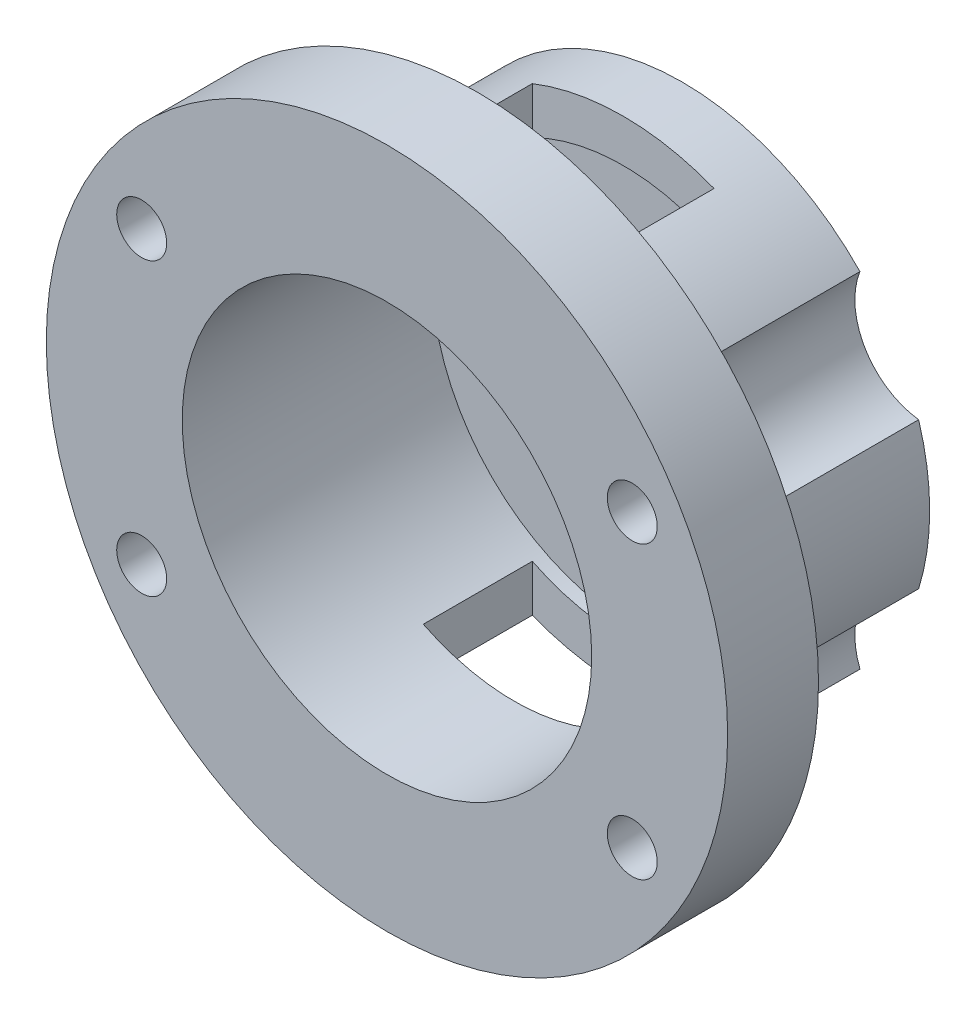
ISO-10303-21;
HEADER;
FILE_DESCRIPTION(('STEP AP214'),'2;1');
FILE_NAME('part.step','',(''),(''),'','','');
FILE_SCHEMA(('AUTOMOTIVE_DESIGN { 1 0 10303 214 1 1 1 1 }'));
ENDSEC;
DATA;
#1=APPLICATION_CONTEXT('core data for automotive mechanical design processes');
#2=APPLICATION_PROTOCOL_DEFINITION('international standard','automotive_design',2000,#1);
#3=PRODUCT_CONTEXT('',#1,'mechanical');
#4=PRODUCT('Part','Part','',(#3));
#5=PRODUCT_RELATED_PRODUCT_CATEGORY('part','',(#4));
#6=PRODUCT_DEFINITION_FORMATION('','',#4);
#7=PRODUCT_DEFINITION_CONTEXT('part definition',#1,'design');
#8=PRODUCT_DEFINITION('design','',#6,#7);
#9=PRODUCT_DEFINITION_SHAPE('','',#8);
#10=(LENGTH_UNIT() NAMED_UNIT(*) SI_UNIT(.MILLI.,.METRE.));
#11=(NAMED_UNIT(*) PLANE_ANGLE_UNIT() SI_UNIT($,.RADIAN.));
#12=(NAMED_UNIT(*) SI_UNIT($,.STERADIAN.) SOLID_ANGLE_UNIT());
#13=UNCERTAINTY_MEASURE_WITH_UNIT(LENGTH_MEASURE(1.E-05),#10,'distance_accuracy_value','');
#14=(GEOMETRIC_REPRESENTATION_CONTEXT(3) GLOBAL_UNCERTAINTY_ASSIGNED_CONTEXT((#13)) GLOBAL_UNIT_ASSIGNED_CONTEXT((#10,
#11,#12)) REPRESENTATION_CONTEXT('',''));
#15=CARTESIAN_POINT('',(0.,0.,0.));
#16=DIRECTION('',(0.,0.,1.));
#17=DIRECTION('',(1.,0.,0.));
#18=AXIS2_PLACEMENT_3D('',#15,#16,#17);
#19=CARTESIAN_POINT('',(0.,0.,8.));
#20=DIRECTION('',(0.,0.,1.));
#21=DIRECTION('',(1.,0.,0.));
#22=AXIS2_PLACEMENT_3D('',#19,#20,#21);
#23=CYLINDRICAL_SURFACE('',#22,22.5361893631846);
#24=CARTESIAN_POINT('',(0.,0.,20.));
#25=DIRECTION('',(0.,0.,1.));
#26=DIRECTION('',(1.,0.,0.));
#27=AXIS2_PLACEMENT_3D('',#24,#25,#26);
#28=CIRCLE('',#27,22.5361893631846);
#29=CARTESIAN_POINT('',(22.5361893631846,0.,20.));
#30=VERTEX_POINT('',#29);
#31=EDGE_CURVE('E292',#30,#30,#28,.T.);
#32=ORIENTED_EDGE('',*,*,#31,.T.);
#33=EDGE_LOOP('',(#32));
#34=FACE_BOUND('',#33,.T.);
#35=CARTESIAN_POINT('',(0.,0.,-6.));
#36=DIRECTION('',(0.,0.,-1.));
#37=DIRECTION('',(-1.,0.,0.));
#38=AXIS2_PLACEMENT_3D('',#35,#36,#37);
#39=CIRCLE('',#38,22.5361893631846);
#40=CARTESIAN_POINT('',(10.,20.1960350319886,-6.));
#41=VERTEX_POINT('',#40);
#42=CARTESIAN_POINT('',(-9.99999999999999,20.1960350319886,-6.));
#43=VERTEX_POINT('',#42);
#44=EDGE_CURVE('E238',#41,#43,#39,.F.);
#45=ORIENTED_EDGE('',*,*,#44,.T.);
#46=DIRECTION('',(0.,0.,1.));
#47=VECTOR('',#46,1.);
#48=CARTESIAN_POINT('',(-9.99999999999999,20.1960350319886,8.));
#49=LINE('',#48,#47);
#50=CARTESIAN_POINT('',(-9.99999999999999,20.1960350319886,6.));
#51=VERTEX_POINT('',#50);
#52=EDGE_CURVE('E244',#43,#51,#49,.T.);
#53=ORIENTED_EDGE('',*,*,#52,.T.);
#54=CARTESIAN_POINT('',(0.,0.,6.));
#55=DIRECTION('',(0.,0.,1.));
#56=DIRECTION('',(1.,0.,0.));
#57=AXIS2_PLACEMENT_3D('',#54,#55,#56);
#58=CIRCLE('',#57,22.5361893631846);
#59=CARTESIAN_POINT('',(9.99999999999999,20.1960350319886,6.));
#60=VERTEX_POINT('',#59);
#61=EDGE_CURVE('E224',#51,#60,#58,.F.);
#62=ORIENTED_EDGE('',*,*,#61,.T.);
#63=DIRECTION('',(0.,0.,1.));
#64=VECTOR('',#63,1.);
#65=CARTESIAN_POINT('',(9.99999999999999,20.1960350319886,8.));
#66=LINE('',#65,#64);
#67=EDGE_CURVE('E233',#60,#41,#66,.F.);
#68=ORIENTED_EDGE('',*,*,#67,.T.);
#69=EDGE_LOOP('',(#45,#53,#62,#68));
#70=FACE_BOUND('',#69,.T.);
#71=CARTESIAN_POINT('',(9.99999999999999,-20.1960350319886,6.));
#72=VERTEX_POINT('',#71);
#73=CARTESIAN_POINT('',(-9.99999999999999,-20.1960350319886,6.));
#74=VERTEX_POINT('',#73);
#75=EDGE_CURVE('E227',#72,#74,#58,.F.);
#76=ORIENTED_EDGE('',*,*,#75,.T.);
#77=DIRECTION('',(0.,0.,1.));
#78=VECTOR('',#77,1.);
#79=CARTESIAN_POINT('',(-9.99999999999999,-20.1960350319886,8.));
#80=LINE('',#79,#78);
#81=CARTESIAN_POINT('',(-9.99999999999999,-20.1960350319886,-6.));
#82=VERTEX_POINT('',#81);
#83=EDGE_CURVE('E247',#74,#82,#80,.F.);
#84=ORIENTED_EDGE('',*,*,#83,.T.);
#85=CARTESIAN_POINT('',(10.,-20.1960350319887,-6.));
#86=VERTEX_POINT('',#85);
#87=EDGE_CURVE('E241',#82,#86,#39,.F.);
#88=ORIENTED_EDGE('',*,*,#87,.T.);
#89=DIRECTION('',(0.,0.,1.));
#90=VECTOR('',#89,1.);
#91=CARTESIAN_POINT('',(9.99999999999999,-20.1960350319886,8.));
#92=LINE('',#91,#90);
#93=EDGE_CURVE('E230',#86,#72,#92,.T.);
#94=ORIENTED_EDGE('',*,*,#93,.T.);
#95=EDGE_LOOP('',(#76,#84,#88,#94));
#96=FACE_BOUND('',#95,.T.);
#97=CARTESIAN_POINT('',(0.,0.,-7.5));
#98=DIRECTION('',(0.,0.,-1.));
#99=DIRECTION('',(-1.,0.,0.));
#100=AXIS2_PLACEMENT_3D('',#97,#98,#99);
#101=CIRCLE('',#100,22.5361893631846);
#102=CARTESIAN_POINT('',(-22.5361893631846,0.,-7.5));
#103=VERTEX_POINT('',#102);
#104=EDGE_CURVE('E11',#103,#103,#101,.F.);
#105=ORIENTED_EDGE('',*,*,#104,.F.);
#106=EDGE_LOOP('',(#105));
#107=FACE_BOUND('',#106,.T.);
#108=ADVANCED_FACE('F43',(#34,#70,#96,#107),#23,.F.);
#109=CARTESIAN_POINT('',(0.,0.,10.));
#110=DIRECTION('',(0.,0.,-1.));
#111=DIRECTION('',(-1.,0.,0.));
#112=AXIS2_PLACEMENT_3D('',#109,#110,#111);
#113=CYLINDRICAL_SURFACE('',#112,27.2402260374026);
#114=DIRECTION('',(0.,0.,-1.));
#115=VECTOR('',#114,1.);
#116=CARTESIAN_POINT('',(-26.0204366331113,-8.06019801189918,5.));
#117=LINE('',#116,#115);
#118=CARTESIAN_POINT('',(-26.0204366331113,-8.06019801189918,10.));
#119=VERTEX_POINT('',#118);
#120=CARTESIAN_POINT('',(-26.0204366331113,-8.06019801189918,-12.5));
#121=VERTEX_POINT('',#120);
#122=EDGE_CURVE('E272',#119,#121,#117,.T.);
#123=ORIENTED_EDGE('',*,*,#122,.F.);
#124=CARTESIAN_POINT('',(0.,0.,10.));
#125=DIRECTION('',(0.,0.,-1.));
#126=DIRECTION('',(-1.,0.,0.));
#127=AXIS2_PLACEMENT_3D('',#124,#125,#126);
#128=CIRCLE('',#127,27.2402260374026);
#129=CARTESIAN_POINT('',(-26.0204366331113,8.06019801189919,10.));
#130=VERTEX_POINT('',#129);
#131=EDGE_CURVE('E274',#119,#130,#128,.T.);
#132=ORIENTED_EDGE('',*,*,#131,.T.);
#133=DIRECTION('',(0.,0.,-1.));
#134=VECTOR('',#133,1.);
#135=CARTESIAN_POINT('',(-26.0204366331113,8.06019801189919,5.));
#136=LINE('',#135,#134);
#137=CARTESIAN_POINT('',(-26.0204366331113,8.0601980118992,-12.5));
#138=VERTEX_POINT('',#137);
#139=EDGE_CURVE('E262',#138,#130,#136,.F.);
#140=ORIENTED_EDGE('',*,*,#139,.F.);
#141=CARTESIAN_POINT('',(0.,0.,-12.5));
#142=DIRECTION('',(0.,0.,-1.));
#143=DIRECTION('',(-1.,0.,0.));
#144=AXIS2_PLACEMENT_3D('',#141,#142,#143);
#145=CIRCLE('',#144,27.2402260374026);
#146=EDGE_CURVE('E192',#121,#138,#145,.T.);
#147=ORIENTED_EDGE('',*,*,#146,.F.);
#148=EDGE_LOOP('',(#123,#132,#140,#147));
#149=FACE_BOUND('',#148,.T.);
#150=ADVANCED_FACE('F345',(#149),#113,.T.);
#151=DIRECTION('',(0.,0.,-1.));
#152=VECTOR('',#151,1.);
#153=CARTESIAN_POINT('',(-9.99999999999999,-25.3383092286914,10.));
#154=LINE('',#153,#152);
#155=CARTESIAN_POINT('',(-9.99999999999999,-25.3383092286914,6.));
#156=VERTEX_POINT('',#155);
#157=CARTESIAN_POINT('',(-9.99999999999999,-25.3383092286914,-6.));
#158=VERTEX_POINT('',#157);
#159=EDGE_CURVE('E250',#156,#158,#154,.T.);
#160=ORIENTED_EDGE('',*,*,#159,.F.);
#161=CARTESIAN_POINT('',(0.,0.,6.));
#162=DIRECTION('',(0.,0.,1.));
#163=DIRECTION('',(1.,0.,0.));
#164=AXIS2_PLACEMENT_3D('',#161,#162,#163);
#165=CIRCLE('',#164,27.2402260374026);
#166=CARTESIAN_POINT('',(9.99999999999999,-25.3383092286914,6.));
#167=VERTEX_POINT('',#166);
#168=EDGE_CURVE('E228',#167,#156,#165,.F.);
#169=ORIENTED_EDGE('',*,*,#168,.F.);
#170=DIRECTION('',(0.,0.,-1.));
#171=VECTOR('',#170,1.);
#172=CARTESIAN_POINT('',(9.99999999999999,-25.3383092286914,10.));
#173=LINE('',#172,#171);
#174=CARTESIAN_POINT('',(10.,-25.3383092286914,-6.));
#175=VERTEX_POINT('',#174);
#176=EDGE_CURVE('E236',#175,#167,#173,.F.);
#177=ORIENTED_EDGE('',*,*,#176,.F.);
#178=CARTESIAN_POINT('',(0.,0.,-6.));
#179=DIRECTION('',(0.,0.,-1.));
#180=DIRECTION('',(-1.,0.,0.));
#181=AXIS2_PLACEMENT_3D('',#178,#179,#180);
#182=CIRCLE('',#181,27.2402260374026);
#183=EDGE_CURVE('E242',#158,#175,#182,.F.);
#184=ORIENTED_EDGE('',*,*,#183,.F.);
#185=EDGE_LOOP('',(#160,#169,#177,#184));
#186=FACE_BOUND('',#185,.T.);
#187=DIRECTION('',(0.,0.,-1.));
#188=VECTOR('',#187,1.);
#189=CARTESIAN_POINT('',(-19.5651549337488,-18.9534858795735,5.));
#190=LINE('',#189,#188);
#191=CARTESIAN_POINT('',(-19.5651549337488,-18.9534858795735,-12.5));
#192=VERTEX_POINT('',#191);
#193=CARTESIAN_POINT('',(-19.5651549337488,-18.9534858795735,10.));
#194=VERTEX_POINT('',#193);
#195=EDGE_CURVE('E270',#192,#194,#190,.F.);
#196=ORIENTED_EDGE('',*,*,#195,.F.);
#197=CARTESIAN_POINT('',(0.,0.,-12.5));
#198=DIRECTION('',(0.,0.,-1.));
#199=DIRECTION('',(-1.,0.,0.));
#200=AXIS2_PLACEMENT_3D('',#197,#198,#199);
#201=CIRCLE('',#200,27.2402260374026);
#202=CARTESIAN_POINT('',(19.5651549337488,-18.9534858795735,-12.5));
#203=VERTEX_POINT('',#202);
#204=EDGE_CURVE('E186',#203,#192,#201,.T.);
#205=ORIENTED_EDGE('',*,*,#204,.F.);
#206=DIRECTION('',(0.,0.,-1.));
#207=VECTOR('',#206,1.);
#208=CARTESIAN_POINT('',(19.5651549337488,-18.9534858795735,5.));
#209=LINE('',#208,#207);
#210=CARTESIAN_POINT('',(19.5651549337488,-18.9534858795735,10.));
#211=VERTEX_POINT('',#210);
#212=EDGE_CURVE('E268',#211,#203,#209,.T.);
#213=ORIENTED_EDGE('',*,*,#212,.F.);
#214=EDGE_CURVE('E277',#211,#194,#128,.T.);
#215=ORIENTED_EDGE('',*,*,#214,.T.);
#216=EDGE_LOOP('',(#196,#205,#213,#215));
#217=FACE_BOUND('',#216,.T.);
#218=ADVANCED_FACE('F351',(#186,#217),#113,.T.);
#219=DIRECTION('',(0.,0.,-1.));
#220=VECTOR('',#219,1.);
#221=CARTESIAN_POINT('',(26.0204366331113,-8.06019801189917,5.));
#222=LINE('',#221,#220);
#223=CARTESIAN_POINT('',(26.0204366331114,-8.06019801189915,-12.5));
#224=VERTEX_POINT('',#223);
#225=CARTESIAN_POINT('',(26.0204366331113,-8.06019801189917,10.));
#226=VERTEX_POINT('',#225);
#227=EDGE_CURVE('E167',#224,#226,#222,.F.);
#228=ORIENTED_EDGE('',*,*,#227,.F.);
#229=CARTESIAN_POINT('',(0.,0.,-12.5));
#230=DIRECTION('',(0.,0.,-1.));
#231=DIRECTION('',(-1.,0.,0.));
#232=AXIS2_PLACEMENT_3D('',#229,#230,#231);
#233=CIRCLE('',#232,27.2402260374026);
#234=CARTESIAN_POINT('',(26.0204366331113,8.06019801189918,-12.5));
#235=VERTEX_POINT('',#234);
#236=EDGE_CURVE('E171',#235,#224,#233,.T.);
#237=ORIENTED_EDGE('',*,*,#236,.F.);
#238=DIRECTION('',(0.,0.,-1.));
#239=VECTOR('',#238,1.);
#240=CARTESIAN_POINT('',(26.0204366331113,8.06019801189918,5.));
#241=LINE('',#240,#239);
#242=CARTESIAN_POINT('',(26.0204366331113,8.06019801189918,10.));
#243=VERTEX_POINT('',#242);
#244=EDGE_CURVE('E157',#243,#235,#241,.T.);
#245=ORIENTED_EDGE('',*,*,#244,.F.);
#246=EDGE_CURVE('E432',#243,#226,#128,.T.);
#247=ORIENTED_EDGE('',*,*,#246,.T.);
#248=EDGE_LOOP('',(#228,#237,#245,#247));
#249=FACE_BOUND('',#248,.T.);
#250=ADVANCED_FACE('F172',(#249),#113,.T.);
#251=CARTESIAN_POINT('',(0.,0.,20.));
#252=DIRECTION('',(0.,0.,-1.));
#253=DIRECTION('',(-1.,0.,0.));
#254=AXIS2_PLACEMENT_3D('',#251,#252,#253);
#255=CYLINDRICAL_SURFACE('',#254,37.5);
#256=CARTESIAN_POINT('',(0.,0.,20.));
#257=DIRECTION('',(0.,0.,1.));
#258=DIRECTION('',(1.,0.,0.));
#259=AXIS2_PLACEMENT_3D('',#256,#257,#258);
#260=CIRCLE('',#259,37.5);
#261=CARTESIAN_POINT('',(37.5,0.,20.));
#262=VERTEX_POINT('',#261);
#263=EDGE_CURVE('E307',#262,#262,#260,.T.);
#264=ORIENTED_EDGE('',*,*,#263,.F.);
#265=EDGE_LOOP('',(#264));
#266=FACE_BOUND('',#265,.T.);
#267=CARTESIAN_POINT('',(0.,0.,10.));
#268=DIRECTION('',(0.,0.,-1.));
#269=DIRECTION('',(-1.,0.,0.));
#270=AXIS2_PLACEMENT_3D('',#267,#268,#269);
#271=CIRCLE('',#270,37.5);
#272=CARTESIAN_POINT('',(-37.5,0.,10.));
#273=VERTEX_POINT('',#272);
#274=EDGE_CURVE('E279',#273,#273,#271,.T.);
#275=ORIENTED_EDGE('',*,*,#274,.F.);
#276=EDGE_LOOP('',(#275));
#277=FACE_BOUND('',#276,.T.);
#278=ADVANCED_FACE('F45',(#266,#277),#255,.T.);
#279=CARTESIAN_POINT('',(-27.,16.,20.));
#280=DIRECTION('',(0.,0.,-1.));
#281=DIRECTION('',(-1.,0.,0.));
#282=AXIS2_PLACEMENT_3D('',#279,#280,#281);
#283=CYLINDRICAL_SURFACE('',#282,2.75);
#284=CARTESIAN_POINT('',(-27.,16.,20.));
#285=DIRECTION('',(0.,0.,1.));
#286=DIRECTION('',(1.,0.,0.));
#287=AXIS2_PLACEMENT_3D('',#284,#285,#286);
#288=CIRCLE('',#287,2.75);
#289=CARTESIAN_POINT('',(-24.25,16.,20.));
#290=VERTEX_POINT('',#289);
#291=EDGE_CURVE('E304',#290,#290,#288,.T.);
#292=ORIENTED_EDGE('',*,*,#291,.T.);
#293=EDGE_LOOP('',(#292));
#294=FACE_BOUND('',#293,.T.);
#295=CARTESIAN_POINT('',(-27.,16.,10.));
#296=DIRECTION('',(0.,0.,-1.));
#297=DIRECTION('',(-1.,0.,0.));
#298=AXIS2_PLACEMENT_3D('',#295,#296,#297);
#299=CIRCLE('',#298,2.75);
#300=CARTESIAN_POINT('',(-29.75,16.,10.));
#301=VERTEX_POINT('',#300);
#302=EDGE_CURVE('E289',#301,#301,#299,.T.);
#303=ORIENTED_EDGE('',*,*,#302,.T.);
#304=EDGE_LOOP('',(#303));
#305=FACE_BOUND('',#304,.T.);
#306=ADVANCED_FACE('F371',(#294,#305),#283,.F.);
#307=CARTESIAN_POINT('',(27.,16.,20.));
#308=DIRECTION('',(0.,0.,-1.));
#309=DIRECTION('',(-1.,0.,0.));
#310=AXIS2_PLACEMENT_3D('',#307,#308,#309);
#311=CYLINDRICAL_SURFACE('',#310,2.75);
#312=CARTESIAN_POINT('',(27.,16.,20.));
#313=DIRECTION('',(0.,0.,1.));
#314=DIRECTION('',(1.,0.,0.));
#315=AXIS2_PLACEMENT_3D('',#312,#313,#314);
#316=CIRCLE('',#315,2.75);
#317=CARTESIAN_POINT('',(29.75,16.,20.));
#318=VERTEX_POINT('',#317);
#319=EDGE_CURVE('E301',#318,#318,#316,.T.);
#320=ORIENTED_EDGE('',*,*,#319,.T.);
#321=EDGE_LOOP('',(#320));
#322=FACE_BOUND('',#321,.T.);
#323=CARTESIAN_POINT('',(27.,16.,10.));
#324=DIRECTION('',(0.,0.,-1.));
#325=DIRECTION('',(-1.,0.,0.));
#326=AXIS2_PLACEMENT_3D('',#323,#324,#325);
#327=CIRCLE('',#326,2.75);
#328=CARTESIAN_POINT('',(24.25,16.,10.));
#329=VERTEX_POINT('',#328);
#330=EDGE_CURVE('E286',#329,#329,#327,.T.);
#331=ORIENTED_EDGE('',*,*,#330,.T.);
#332=EDGE_LOOP('',(#331));
#333=FACE_BOUND('',#332,.T.);
#334=ADVANCED_FACE('F367',(#322,#333),#311,.F.);
#335=CARTESIAN_POINT('',(-27.,-16.,20.));
#336=DIRECTION('',(0.,0.,-1.));
#337=DIRECTION('',(-1.,0.,0.));
#338=AXIS2_PLACEMENT_3D('',#335,#336,#337);
#339=CYLINDRICAL_SURFACE('',#338,2.75);
#340=CARTESIAN_POINT('',(-27.,-16.,20.));
#341=DIRECTION('',(0.,0.,1.));
#342=DIRECTION('',(1.,0.,0.));
#343=AXIS2_PLACEMENT_3D('',#340,#341,#342);
#344=CIRCLE('',#343,2.75);
#345=CARTESIAN_POINT('',(-24.25,-16.,20.));
#346=VERTEX_POINT('',#345);
#347=EDGE_CURVE('E298',#346,#346,#344,.T.);
#348=ORIENTED_EDGE('',*,*,#347,.T.);
#349=EDGE_LOOP('',(#348));
#350=FACE_BOUND('',#349,.T.);
#351=CARTESIAN_POINT('',(-27.,-16.,10.));
#352=DIRECTION('',(0.,0.,-1.));
#353=DIRECTION('',(-1.,0.,0.));
#354=AXIS2_PLACEMENT_3D('',#351,#352,#353);
#355=CIRCLE('',#354,2.75);
#356=CARTESIAN_POINT('',(-29.75,-16.,10.));
#357=VERTEX_POINT('',#356);
#358=EDGE_CURVE('E283',#357,#357,#355,.T.);
#359=ORIENTED_EDGE('',*,*,#358,.T.);
#360=EDGE_LOOP('',(#359));
#361=FACE_BOUND('',#360,.T.);
#362=ADVANCED_FACE('F363',(#350,#361),#339,.F.);
#363=CARTESIAN_POINT('',(27.,-16.,20.));
#364=DIRECTION('',(0.,0.,-1.));
#365=DIRECTION('',(-1.,0.,0.));
#366=AXIS2_PLACEMENT_3D('',#363,#364,#365);
#367=CYLINDRICAL_SURFACE('',#366,2.75);
#368=CARTESIAN_POINT('',(27.,-16.,20.));
#369=DIRECTION('',(0.,0.,1.));
#370=DIRECTION('',(1.,0.,0.));
#371=AXIS2_PLACEMENT_3D('',#368,#369,#370);
#372=CIRCLE('',#371,2.75);
#373=CARTESIAN_POINT('',(29.75,-16.,20.));
#374=VERTEX_POINT('',#373);
#375=EDGE_CURVE('E295',#374,#374,#372,.T.);
#376=ORIENTED_EDGE('',*,*,#375,.T.);
#377=EDGE_LOOP('',(#376));
#378=FACE_BOUND('',#377,.T.);
#379=CARTESIAN_POINT('',(27.,-16.,10.));
#380=DIRECTION('',(0.,0.,-1.));
#381=DIRECTION('',(-1.,0.,0.));
#382=AXIS2_PLACEMENT_3D('',#379,#380,#381);
#383=CIRCLE('',#382,2.75);
#384=CARTESIAN_POINT('',(24.25,-16.,10.));
#385=VERTEX_POINT('',#384);
#386=EDGE_CURVE('E282',#385,#385,#383,.T.);
#387=ORIENTED_EDGE('',*,*,#386,.T.);
#388=EDGE_LOOP('',(#387));
#389=FACE_BOUND('',#388,.T.);
#390=ADVANCED_FACE('F359',(#378,#389),#367,.F.);
#391=CARTESIAN_POINT('',(0.,0.,20.));
#392=DIRECTION('',(0.,0.,1.));
#393=DIRECTION('',(1.,0.,0.));
#394=AXIS2_PLACEMENT_3D('',#391,#392,#393);
#395=PLANE('',#394);
#396=ORIENTED_EDGE('',*,*,#31,.F.);
#397=EDGE_LOOP('',(#396));
#398=FACE_BOUND('',#397,.T.);
#399=ORIENTED_EDGE('',*,*,#347,.F.);
#400=EDGE_LOOP('',(#399));
#401=FACE_BOUND('',#400,.T.);
#402=ORIENTED_EDGE('',*,*,#291,.F.);
#403=EDGE_LOOP('',(#402));
#404=FACE_BOUND('',#403,.T.);
#405=ORIENTED_EDGE('',*,*,#263,.T.);
#406=EDGE_LOOP('',(#405));
#407=FACE_BOUND('',#406,.T.);
#408=ORIENTED_EDGE('',*,*,#319,.F.);
#409=EDGE_LOOP('',(#408));
#410=FACE_BOUND('',#409,.T.);
#411=ORIENTED_EDGE('',*,*,#375,.F.);
#412=EDGE_LOOP('',(#411));
#413=FACE_BOUND('',#412,.T.);
#414=ADVANCED_FACE('F362',(#398,#401,#404,#407,#410,#413),#395,.T.);
#415=CARTESIAN_POINT('',(0.,0.,10.));
#416=DIRECTION('',(0.,0.,-1.));
#417=DIRECTION('',(-1.,0.,0.));
#418=AXIS2_PLACEMENT_3D('',#415,#416,#417);
#419=PLANE('',#418);
#420=ORIENTED_EDGE('',*,*,#131,.F.);
#421=CARTESIAN_POINT('',(-27.,-16.,10.));
#422=DIRECTION('',(0.,0.,-1.));
#423=DIRECTION('',(-1.,0.,0.));
#424=AXIS2_PLACEMENT_3D('',#421,#422,#423);
#425=CIRCLE('',#424,7.99999999999999);
#426=EDGE_CURVE('E252',#119,#194,#425,.T.);
#427=ORIENTED_EDGE('',*,*,#426,.T.);
#428=ORIENTED_EDGE('',*,*,#214,.F.);
#429=CARTESIAN_POINT('',(27.,-16.,10.));
#430=DIRECTION('',(0.,0.,-1.));
#431=DIRECTION('',(-1.,0.,0.));
#432=AXIS2_PLACEMENT_3D('',#429,#430,#431);
#433=CIRCLE('',#432,8.);
#434=EDGE_CURVE('E255',#211,#226,#433,.T.);
#435=ORIENTED_EDGE('',*,*,#434,.T.);
#436=ORIENTED_EDGE('',*,*,#246,.F.);
#437=CARTESIAN_POINT('',(27.,16.,10.));
#438=DIRECTION('',(0.,0.,-1.));
#439=DIRECTION('',(-1.,0.,0.));
#440=AXIS2_PLACEMENT_3D('',#437,#438,#439);
#441=CIRCLE('',#440,8.);
#442=CARTESIAN_POINT('',(19.5651549337488,18.9534858795735,10.));
#443=VERTEX_POINT('',#442);
#444=EDGE_CURVE('E163',#243,#443,#441,.T.);
#445=ORIENTED_EDGE('',*,*,#444,.T.);
#446=CARTESIAN_POINT('',(-19.5651549337488,18.9534858795735,10.));
#447=VERTEX_POINT('',#446);
#448=EDGE_CURVE('E278',#447,#443,#128,.T.);
#449=ORIENTED_EDGE('',*,*,#448,.F.);
#450=CARTESIAN_POINT('',(-27.,16.,10.));
#451=DIRECTION('',(0.,0.,-1.));
#452=DIRECTION('',(-1.,0.,0.));
#453=AXIS2_PLACEMENT_3D('',#450,#451,#452);
#454=CIRCLE('',#453,8.);
#455=EDGE_CURVE('E254',#447,#130,#454,.T.);
#456=ORIENTED_EDGE('',*,*,#455,.T.);
#457=EDGE_LOOP('',(#420,#427,#428,#435,#436,#445,#449,#456));
#458=FACE_BOUND('',#457,.T.);
#459=ORIENTED_EDGE('',*,*,#274,.T.);
#460=EDGE_LOOP('',(#459));
#461=FACE_BOUND('',#460,.T.);
#462=ORIENTED_EDGE('',*,*,#386,.F.);
#463=EDGE_LOOP('',(#462));
#464=FACE_BOUND('',#463,.T.);
#465=ORIENTED_EDGE('',*,*,#302,.F.);
#466=EDGE_LOOP('',(#465));
#467=FACE_BOUND('',#466,.T.);
#468=ORIENTED_EDGE('',*,*,#330,.F.);
#469=EDGE_LOOP('',(#468));
#470=FACE_BOUND('',#469,.T.);
#471=ORIENTED_EDGE('',*,*,#358,.F.);
#472=EDGE_LOOP('',(#471));
#473=FACE_BOUND('',#472,.T.);
#474=ADVANCED_FACE('F358',(#458,#461,#464,#467,#470,#473),#419,.T.);
#475=DIRECTION('',(0.,0.,-1.));
#476=VECTOR('',#475,1.);
#477=CARTESIAN_POINT('',(-9.99999999999999,25.3383092286914,10.));
#478=LINE('',#477,#476);
#479=CARTESIAN_POINT('',(-9.99999999999999,25.3383092286914,-6.));
#480=VERTEX_POINT('',#479);
#481=CARTESIAN_POINT('',(-9.99999999999999,25.3383092286914,6.));
#482=VERTEX_POINT('',#481);
#483=EDGE_CURVE('E52',#480,#482,#478,.F.);
#484=ORIENTED_EDGE('',*,*,#483,.F.);
#485=CARTESIAN_POINT('',(0.,0.,-6.));
#486=DIRECTION('',(0.,0.,-1.));
#487=DIRECTION('',(-1.,0.,0.));
#488=AXIS2_PLACEMENT_3D('',#485,#486,#487);
#489=CIRCLE('',#488,27.2402260374026);
#490=CARTESIAN_POINT('',(10.,25.3383092286913,-6.));
#491=VERTEX_POINT('',#490);
#492=EDGE_CURVE('E316',#491,#480,#489,.F.);
#493=ORIENTED_EDGE('',*,*,#492,.F.);
#494=DIRECTION('',(0.,0.,-1.));
#495=VECTOR('',#494,1.);
#496=CARTESIAN_POINT('',(9.99999999999999,25.3383092286914,10.));
#497=LINE('',#496,#495);
#498=CARTESIAN_POINT('',(9.99999999999999,25.3383092286914,6.));
#499=VERTEX_POINT('',#498);
#500=EDGE_CURVE('E314',#499,#491,#497,.T.);
#501=ORIENTED_EDGE('',*,*,#500,.F.);
#502=CARTESIAN_POINT('',(0.,0.,6.));
#503=DIRECTION('',(0.,0.,1.));
#504=DIRECTION('',(1.,0.,0.));
#505=AXIS2_PLACEMENT_3D('',#502,#503,#504);
#506=CIRCLE('',#505,27.2402260374026);
#507=EDGE_CURVE('E310',#482,#499,#506,.F.);
#508=ORIENTED_EDGE('',*,*,#507,.F.);
#509=EDGE_LOOP('',(#484,#493,#501,#508));
#510=FACE_BOUND('',#509,.T.);
#511=DIRECTION('',(0.,0.,-1.));
#512=VECTOR('',#511,1.);
#513=CARTESIAN_POINT('',(19.5651549337488,18.9534858795735,5.));
#514=LINE('',#513,#512);
#515=CARTESIAN_POINT('',(19.5651549337488,18.9534858795735,-12.5));
#516=VERTEX_POINT('',#515);
#517=EDGE_CURVE('E168',#516,#443,#514,.F.);
#518=ORIENTED_EDGE('',*,*,#517,.F.);
#519=CARTESIAN_POINT('',(0.,0.,-12.5));
#520=DIRECTION('',(0.,0.,-1.));
#521=DIRECTION('',(-1.,0.,0.));
#522=AXIS2_PLACEMENT_3D('',#519,#520,#521);
#523=CIRCLE('',#522,27.2402260374026);
#524=CARTESIAN_POINT('',(-19.5651549337488,18.9534858795735,-12.5));
#525=VERTEX_POINT('',#524);
#526=EDGE_CURVE('E182',#525,#516,#523,.T.);
#527=ORIENTED_EDGE('',*,*,#526,.F.);
#528=DIRECTION('',(0.,0.,-1.));
#529=VECTOR('',#528,1.);
#530=CARTESIAN_POINT('',(-19.5651549337488,18.9534858795735,5.));
#531=LINE('',#530,#529);
#532=EDGE_CURVE('E264',#447,#525,#531,.T.);
#533=ORIENTED_EDGE('',*,*,#532,.F.);
#534=ORIENTED_EDGE('',*,*,#448,.T.);
#535=EDGE_LOOP('',(#518,#527,#533,#534));
#536=FACE_BOUND('',#535,.T.);
#537=ADVANCED_FACE('F354',(#510,#536),#113,.T.);
#538=CARTESIAN_POINT('',(-27.,16.,10.));
#539=DIRECTION('',(0.,0.,-1.));
#540=DIRECTION('',(-1.,0.,0.));
#541=AXIS2_PLACEMENT_3D('',#538,#539,#540);
#542=CYLINDRICAL_SURFACE('',#541,8.);
#543=ORIENTED_EDGE('',*,*,#532,.T.);
#544=CARTESIAN_POINT('',(-27.,16.,-12.5));
#545=DIRECTION('',(0.,0.,1.));
#546=DIRECTION('',(-1.,0.,0.));
#547=AXIS2_PLACEMENT_3D('',#544,#545,#546);
#548=CIRCLE('',#547,7.99999999999999);
#549=EDGE_CURVE('E195',#138,#525,#548,.T.);
#550=ORIENTED_EDGE('',*,*,#549,.F.);
#551=ORIENTED_EDGE('',*,*,#139,.T.);
#552=ORIENTED_EDGE('',*,*,#455,.F.);
#553=EDGE_LOOP('',(#543,#550,#551,#552));
#554=FACE_BOUND('',#553,.T.);
#555=ADVANCED_FACE('F418',(#554),#542,.F.);
#556=CARTESIAN_POINT('',(27.,16.,10.));
#557=DIRECTION('',(0.,0.,-1.));
#558=DIRECTION('',(-1.,0.,0.));
#559=AXIS2_PLACEMENT_3D('',#556,#557,#558);
#560=CYLINDRICAL_SURFACE('',#559,8.);
#561=ORIENTED_EDGE('',*,*,#244,.T.);
#562=CARTESIAN_POINT('',(27.,16.,-12.5));
#563=DIRECTION('',(0.,0.,1.));
#564=DIRECTION('',(-1.,0.,0.));
#565=AXIS2_PLACEMENT_3D('',#562,#563,#564);
#566=CIRCLE('',#565,8.00000000000001);
#567=EDGE_CURVE('E161',#516,#235,#566,.T.);
#568=ORIENTED_EDGE('',*,*,#567,.F.);
#569=ORIENTED_EDGE('',*,*,#517,.T.);
#570=ORIENTED_EDGE('',*,*,#444,.F.);
#571=EDGE_LOOP('',(#561,#568,#569,#570));
#572=FACE_BOUND('',#571,.T.);
#573=ADVANCED_FACE('F159',(#572),#560,.F.);
#574=CARTESIAN_POINT('',(27.,-16.,10.));
#575=DIRECTION('',(0.,0.,-1.));
#576=DIRECTION('',(-1.,0.,0.));
#577=AXIS2_PLACEMENT_3D('',#574,#575,#576);
#578=CYLINDRICAL_SURFACE('',#577,8.);
#579=ORIENTED_EDGE('',*,*,#212,.T.);
#580=CARTESIAN_POINT('',(27.,-16.,-12.5));
#581=DIRECTION('',(0.,0.,1.));
#582=DIRECTION('',(-1.,0.,0.));
#583=AXIS2_PLACEMENT_3D('',#580,#581,#582);
#584=CIRCLE('',#583,8.);
#585=EDGE_CURVE('E176',#224,#203,#584,.T.);
#586=ORIENTED_EDGE('',*,*,#585,.F.);
#587=ORIENTED_EDGE('',*,*,#227,.T.);
#588=ORIENTED_EDGE('',*,*,#434,.F.);
#589=EDGE_LOOP('',(#579,#586,#587,#588));
#590=FACE_BOUND('',#589,.T.);
#591=ADVANCED_FACE('F445',(#590),#578,.F.);
#592=CARTESIAN_POINT('',(-27.,-16.,10.));
#593=DIRECTION('',(0.,0.,-1.));
#594=DIRECTION('',(-1.,0.,0.));
#595=AXIS2_PLACEMENT_3D('',#592,#593,#594);
#596=CYLINDRICAL_SURFACE('',#595,7.99999999999999);
#597=ORIENTED_EDGE('',*,*,#122,.T.);
#598=CARTESIAN_POINT('',(-27.,-16.,-12.5));
#599=DIRECTION('',(0.,0.,1.));
#600=DIRECTION('',(-1.,0.,0.));
#601=AXIS2_PLACEMENT_3D('',#598,#599,#600);
#602=CIRCLE('',#601,7.99999999999999);
#603=EDGE_CURVE('E189',#192,#121,#602,.T.);
#604=ORIENTED_EDGE('',*,*,#603,.F.);
#605=ORIENTED_EDGE('',*,*,#195,.T.);
#606=ORIENTED_EDGE('',*,*,#426,.F.);
#607=EDGE_LOOP('',(#597,#604,#605,#606));
#608=FACE_BOUND('',#607,.T.);
#609=ADVANCED_FACE('F440',(#608),#596,.F.);
#610=CARTESIAN_POINT('',(-10.,-45.,6.));
#611=DIRECTION('',(0.,0.,1.));
#612=DIRECTION('',(1.,0.,0.));
#613=AXIS2_PLACEMENT_3D('',#610,#611,#612);
#614=PLANE('',#613);
#615=DIRECTION('',(0.,1.,0.));
#616=VECTOR('',#615,1.);
#617=CARTESIAN_POINT('',(-10.,-45.,6.));
#618=LINE('',#617,#616);
#619=EDGE_CURVE('E222',#51,#482,#618,.T.);
#620=ORIENTED_EDGE('',*,*,#619,.T.);
#621=ORIENTED_EDGE('',*,*,#507,.T.);
#622=DIRECTION('',(0.,1.,0.));
#623=VECTOR('',#622,1.);
#624=CARTESIAN_POINT('',(10.,-45.,6.));
#625=LINE('',#624,#623);
#626=EDGE_CURVE('E219',#60,#499,#625,.T.);
#627=ORIENTED_EDGE('',*,*,#626,.F.);
#628=ORIENTED_EDGE('',*,*,#61,.F.);
#629=EDGE_LOOP('',(#620,#621,#627,#628));
#630=FACE_BOUND('',#629,.T.);
#631=ADVANCED_FACE('F452',(#630),#614,.F.);
#632=CARTESIAN_POINT('',(10.,-45.,-6.));
#633=DIRECTION('',(1.,0.,0.));
#634=DIRECTION('',(0.,0.,-1.));
#635=AXIS2_PLACEMENT_3D('',#632,#633,#634);
#636=PLANE('',#635);
#637=ORIENTED_EDGE('',*,*,#626,.T.);
#638=ORIENTED_EDGE('',*,*,#500,.T.);
#639=DIRECTION('',(0.,1.,0.));
#640=VECTOR('',#639,1.);
#641=CARTESIAN_POINT('',(10.,-45.,-6.));
#642=LINE('',#641,#640);
#643=EDGE_CURVE('E216',#41,#491,#642,.T.);
#644=ORIENTED_EDGE('',*,*,#643,.F.);
#645=ORIENTED_EDGE('',*,*,#67,.F.);
#646=EDGE_LOOP('',(#637,#638,#644,#645));
#647=FACE_BOUND('',#646,.T.);
#648=ADVANCED_FACE('F466',(#647),#636,.F.);
#649=CARTESIAN_POINT('',(-10.,-45.,-6.));
#650=DIRECTION('',(0.,0.,-1.));
#651=DIRECTION('',(-1.,0.,0.));
#652=AXIS2_PLACEMENT_3D('',#649,#650,#651);
#653=PLANE('',#652);
#654=ORIENTED_EDGE('',*,*,#643,.T.);
#655=ORIENTED_EDGE('',*,*,#492,.T.);
#656=DIRECTION('',(0.,1.,0.));
#657=VECTOR('',#656,1.);
#658=CARTESIAN_POINT('',(-10.,-45.,-6.));
#659=LINE('',#658,#657);
#660=EDGE_CURVE('E211',#43,#480,#659,.T.);
#661=ORIENTED_EDGE('',*,*,#660,.F.);
#662=ORIENTED_EDGE('',*,*,#44,.F.);
#663=EDGE_LOOP('',(#654,#655,#661,#662));
#664=FACE_BOUND('',#663,.T.);
#665=ADVANCED_FACE('F469',(#664),#653,.F.);
#666=CARTESIAN_POINT('',(-10.,-45.,-6.));
#667=DIRECTION('',(-1.,0.,0.));
#668=DIRECTION('',(0.,0.,1.));
#669=AXIS2_PLACEMENT_3D('',#666,#667,#668);
#670=PLANE('',#669);
#671=ORIENTED_EDGE('',*,*,#660,.T.);
#672=ORIENTED_EDGE('',*,*,#483,.T.);
#673=ORIENTED_EDGE('',*,*,#619,.F.);
#674=ORIENTED_EDGE('',*,*,#52,.F.);
#675=EDGE_LOOP('',(#671,#672,#673,#674));
#676=FACE_BOUND('',#675,.T.);
#677=ADVANCED_FACE('F460',(#676),#670,.F.);
#678=ORIENTED_EDGE('',*,*,#159,.T.);
#679=EDGE_CURVE('E214',#158,#82,#659,.T.);
#680=ORIENTED_EDGE('',*,*,#679,.T.);
#681=ORIENTED_EDGE('',*,*,#83,.F.);
#682=EDGE_CURVE('E65',#156,#74,#618,.T.);
#683=ORIENTED_EDGE('',*,*,#682,.F.);
#684=EDGE_LOOP('',(#678,#680,#681,#683));
#685=FACE_BOUND('',#684,.T.);
#686=ADVANCED_FACE('F456',(#685),#670,.F.);
#687=ORIENTED_EDGE('',*,*,#183,.T.);
#688=EDGE_CURVE('E215',#175,#86,#642,.T.);
#689=ORIENTED_EDGE('',*,*,#688,.T.);
#690=ORIENTED_EDGE('',*,*,#87,.F.);
#691=ORIENTED_EDGE('',*,*,#679,.F.);
#692=EDGE_LOOP('',(#687,#689,#690,#691));
#693=FACE_BOUND('',#692,.T.);
#694=ADVANCED_FACE('F459',(#693),#653,.F.);
#695=ORIENTED_EDGE('',*,*,#176,.T.);
#696=EDGE_CURVE('E60',#167,#72,#625,.T.);
#697=ORIENTED_EDGE('',*,*,#696,.T.);
#698=ORIENTED_EDGE('',*,*,#93,.F.);
#699=ORIENTED_EDGE('',*,*,#688,.F.);
#700=EDGE_LOOP('',(#695,#697,#698,#699));
#701=FACE_BOUND('',#700,.T.);
#702=ADVANCED_FACE('F465',(#701),#636,.F.);
#703=ORIENTED_EDGE('',*,*,#168,.T.);
#704=ORIENTED_EDGE('',*,*,#682,.T.);
#705=ORIENTED_EDGE('',*,*,#75,.F.);
#706=ORIENTED_EDGE('',*,*,#696,.F.);
#707=EDGE_LOOP('',(#703,#704,#705,#706));
#708=FACE_BOUND('',#707,.T.);
#709=ADVANCED_FACE('F462',(#708),#614,.F.);
#710=CARTESIAN_POINT('',(0.,0.,-12.5));
#711=DIRECTION('',(0.,0.,-1.));
#712=DIRECTION('',(-1.,0.,0.));
#713=AXIS2_PLACEMENT_3D('',#710,#711,#712);
#714=PLANE('',#713);
#715=CARTESIAN_POINT('',(0.,7.,-12.5));
#716=DIRECTION('',(0.,0.,-1.));
#717=DIRECTION('',(-1.,0.,0.));
#718=AXIS2_PLACEMENT_3D('',#715,#716,#717);
#719=CIRCLE('',#718,1.5);
#720=CARTESIAN_POINT('',(-1.5,7.,-12.5));
#721=VERTEX_POINT('',#720);
#722=EDGE_CURVE('E199',#721,#721,#719,.T.);
#723=ORIENTED_EDGE('',*,*,#722,.F.);
#724=EDGE_LOOP('',(#723));
#725=FACE_BOUND('',#724,.T.);
#726=CARTESIAN_POINT('',(7.,0.,-12.5));
#727=DIRECTION('',(0.,0.,-1.));
#728=DIRECTION('',(-1.,0.,0.));
#729=AXIS2_PLACEMENT_3D('',#726,#727,#728);
#730=CIRCLE('',#729,1.5);
#731=CARTESIAN_POINT('',(5.5,0.,-12.5));
#732=VERTEX_POINT('',#731);
#733=EDGE_CURVE('E203',#732,#732,#730,.T.);
#734=ORIENTED_EDGE('',*,*,#733,.F.);
#735=EDGE_LOOP('',(#734));
#736=FACE_BOUND('',#735,.T.);
#737=CARTESIAN_POINT('',(-7.,0.,-12.5));
#738=DIRECTION('',(0.,0.,-1.));
#739=DIRECTION('',(-1.,0.,0.));
#740=AXIS2_PLACEMENT_3D('',#737,#738,#739);
#741=CIRCLE('',#740,1.5);
#742=CARTESIAN_POINT('',(-8.5,0.,-12.5));
#743=VERTEX_POINT('',#742);
#744=EDGE_CURVE('E206',#743,#743,#741,.T.);
#745=ORIENTED_EDGE('',*,*,#744,.F.);
#746=EDGE_LOOP('',(#745));
#747=FACE_BOUND('',#746,.T.);
#748=CARTESIAN_POINT('',(0.,-7.,-12.5));
#749=DIRECTION('',(0.,0.,-1.));
#750=DIRECTION('',(-1.,0.,0.));
#751=AXIS2_PLACEMENT_3D('',#748,#749,#750);
#752=CIRCLE('',#751,1.5);
#753=CARTESIAN_POINT('',(-1.5,-7.,-12.5));
#754=VERTEX_POINT('',#753);
#755=EDGE_CURVE('E198',#754,#754,#752,.T.);
#756=ORIENTED_EDGE('',*,*,#755,.F.);
#757=EDGE_LOOP('',(#756));
#758=FACE_BOUND('',#757,.T.);
#759=ORIENTED_EDGE('',*,*,#567,.T.);
#760=ORIENTED_EDGE('',*,*,#236,.T.);
#761=ORIENTED_EDGE('',*,*,#585,.T.);
#762=ORIENTED_EDGE('',*,*,#204,.T.);
#763=ORIENTED_EDGE('',*,*,#603,.T.);
#764=ORIENTED_EDGE('',*,*,#146,.T.);
#765=ORIENTED_EDGE('',*,*,#549,.T.);
#766=ORIENTED_EDGE('',*,*,#526,.T.);
#767=EDGE_LOOP('',(#759,#760,#761,#762,#763,#764,#765,#766));
#768=FACE_BOUND('',#767,.T.);
#769=ADVANCED_FACE('F179',(#725,#736,#747,#758,#768),#714,.T.);
#770=CARTESIAN_POINT('',(0.,0.,-7.5));
#771=DIRECTION('',(0.,0.,-1.));
#772=DIRECTION('',(-1.,0.,0.));
#773=AXIS2_PLACEMENT_3D('',#770,#771,#772);
#774=PLANE('',#773);
#775=CARTESIAN_POINT('',(0.,7.,-7.5));
#776=DIRECTION('',(0.,0.,-1.));
#777=DIRECTION('',(-1.,0.,0.));
#778=AXIS2_PLACEMENT_3D('',#775,#776,#777);
#779=CIRCLE('',#778,1.5);
#780=CARTESIAN_POINT('',(-1.5,7.,-7.5));
#781=VERTEX_POINT('',#780);
#782=EDGE_CURVE('E47',#781,#781,#779,.T.);
#783=ORIENTED_EDGE('',*,*,#782,.T.);
#784=EDGE_LOOP('',(#783));
#785=FACE_BOUND('',#784,.T.);
#786=CARTESIAN_POINT('',(7.,0.,-7.5));
#787=DIRECTION('',(0.,0.,-1.));
#788=DIRECTION('',(-1.,0.,0.));
#789=AXIS2_PLACEMENT_3D('',#786,#787,#788);
#790=CIRCLE('',#789,1.5);
#791=CARTESIAN_POINT('',(5.5,0.,-7.5));
#792=VERTEX_POINT('',#791);
#793=EDGE_CURVE('E324',#792,#792,#790,.T.);
#794=ORIENTED_EDGE('',*,*,#793,.T.);
#795=EDGE_LOOP('',(#794));
#796=FACE_BOUND('',#795,.T.);
#797=CARTESIAN_POINT('',(-7.,0.,-7.5));
#798=DIRECTION('',(0.,0.,-1.));
#799=DIRECTION('',(-1.,0.,0.));
#800=AXIS2_PLACEMENT_3D('',#797,#798,#799);
#801=CIRCLE('',#800,1.5);
#802=CARTESIAN_POINT('',(-8.5,0.,-7.5));
#803=VERTEX_POINT('',#802);
#804=EDGE_CURVE('E322',#803,#803,#801,.T.);
#805=ORIENTED_EDGE('',*,*,#804,.T.);
#806=EDGE_LOOP('',(#805));
#807=FACE_BOUND('',#806,.T.);
#808=CARTESIAN_POINT('',(0.,-7.,-7.5));
#809=DIRECTION('',(0.,0.,-1.));
#810=DIRECTION('',(-1.,0.,0.));
#811=AXIS2_PLACEMENT_3D('',#808,#809,#810);
#812=CIRCLE('',#811,1.5);
#813=CARTESIAN_POINT('',(-1.5,-7.,-7.5));
#814=VERTEX_POINT('',#813);
#815=EDGE_CURVE('E202',#814,#814,#812,.T.);
#816=ORIENTED_EDGE('',*,*,#815,.T.);
#817=EDGE_LOOP('',(#816));
#818=FACE_BOUND('',#817,.T.);
#819=ORIENTED_EDGE('',*,*,#104,.T.);
#820=EDGE_LOOP('',(#819));
#821=FACE_BOUND('',#820,.T.);
#822=ADVANCED_FACE('F331',(#785,#796,#807,#818,#821),#774,.F.);
#823=CARTESIAN_POINT('',(0.,-7.,20.));
#824=DIRECTION('',(0.,0.,-1.));
#825=DIRECTION('',(-1.,0.,0.));
#826=AXIS2_PLACEMENT_3D('',#823,#824,#825);
#827=CYLINDRICAL_SURFACE('',#826,1.5);
#828=ORIENTED_EDGE('',*,*,#755,.T.);
#829=EDGE_LOOP('',(#828));
#830=FACE_BOUND('',#829,.T.);
#831=ORIENTED_EDGE('',*,*,#815,.F.);
#832=EDGE_LOOP('',(#831));
#833=FACE_BOUND('',#832,.T.);
#834=ADVANCED_FACE('F476',(#830,#833),#827,.F.);
#835=CARTESIAN_POINT('',(-7.,0.,20.));
#836=DIRECTION('',(0.,0.,-1.));
#837=DIRECTION('',(-1.,0.,0.));
#838=AXIS2_PLACEMENT_3D('',#835,#836,#837);
#839=CYLINDRICAL_SURFACE('',#838,1.5);
#840=ORIENTED_EDGE('',*,*,#744,.T.);
#841=EDGE_LOOP('',(#840));
#842=FACE_BOUND('',#841,.T.);
#843=ORIENTED_EDGE('',*,*,#804,.F.);
#844=EDGE_LOOP('',(#843));
#845=FACE_BOUND('',#844,.T.);
#846=ADVANCED_FACE('F341',(#842,#845),#839,.F.);
#847=CARTESIAN_POINT('',(7.,0.,20.));
#848=DIRECTION('',(0.,0.,-1.));
#849=DIRECTION('',(-1.,0.,0.));
#850=AXIS2_PLACEMENT_3D('',#847,#848,#849);
#851=CYLINDRICAL_SURFACE('',#850,1.5);
#852=ORIENTED_EDGE('',*,*,#733,.T.);
#853=EDGE_LOOP('',(#852));
#854=FACE_BOUND('',#853,.T.);
#855=ORIENTED_EDGE('',*,*,#793,.F.);
#856=EDGE_LOOP('',(#855));
#857=FACE_BOUND('',#856,.T.);
#858=ADVANCED_FACE('F335',(#854,#857),#851,.F.);
#859=CARTESIAN_POINT('',(0.,7.,20.));
#860=DIRECTION('',(0.,0.,-1.));
#861=DIRECTION('',(-1.,0.,0.));
#862=AXIS2_PLACEMENT_3D('',#859,#860,#861);
#863=CYLINDRICAL_SURFACE('',#862,1.5);
#864=ORIENTED_EDGE('',*,*,#722,.T.);
#865=EDGE_LOOP('',(#864));
#866=FACE_BOUND('',#865,.T.);
#867=ORIENTED_EDGE('',*,*,#782,.F.);
#868=EDGE_LOOP('',(#867));
#869=FACE_BOUND('',#868,.T.);
#870=ADVANCED_FACE('F333',(#866,#869),#863,.F.);
#871=CLOSED_SHELL('',(#108,#150,#218,#250,#278,#306,#334,#362,#390,#414,#474,#537,#555,#573,
#591,#609,#631,#648,#665,#677,#686,#694,#702,#709,#769,#822,#834,#846,#858,#870));
#872=MANIFOLD_SOLID_BREP('B2',#871);
#873=ADVANCED_BREP_SHAPE_REPRESENTATION('',(#18,#872),#14);
#874=SHAPE_DEFINITION_REPRESENTATION(#9,#873);
ENDSEC;
END-ISO-10303-21;
